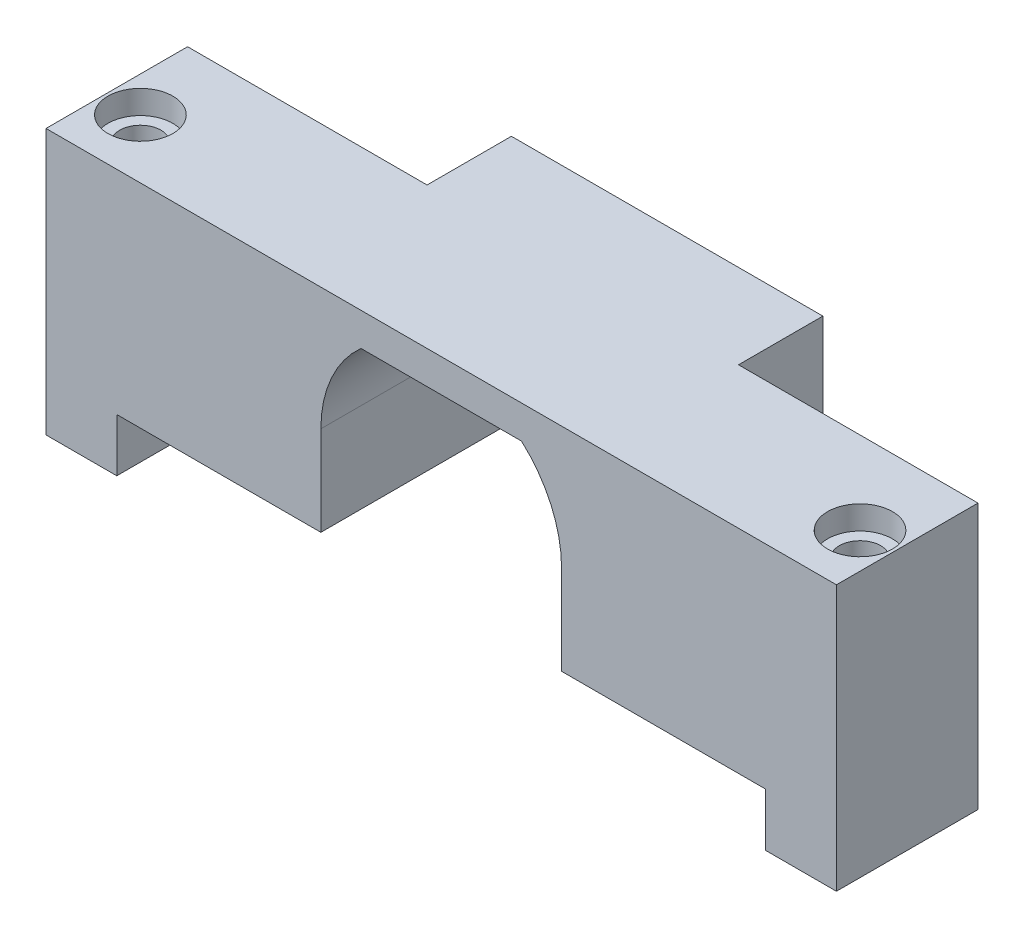
ISO-10303-21;
HEADER;
FILE_DESCRIPTION(('STEP AP214'),'2;1');
FILE_NAME('part.step','',(''),(''),'','','');
FILE_SCHEMA(('AUTOMOTIVE_DESIGN { 1 0 10303 214 1 1 1 1 }'));
ENDSEC;
DATA;
#1=APPLICATION_CONTEXT('core data for automotive mechanical design processes');
#2=APPLICATION_PROTOCOL_DEFINITION('international standard','automotive_design',2000,#1);
#3=PRODUCT_CONTEXT('',#1,'mechanical');
#4=PRODUCT('Part','Part','',(#3));
#5=PRODUCT_RELATED_PRODUCT_CATEGORY('part','',(#4));
#6=PRODUCT_DEFINITION_FORMATION('','',#4);
#7=PRODUCT_DEFINITION_CONTEXT('part definition',#1,'design');
#8=PRODUCT_DEFINITION('design','',#6,#7);
#9=PRODUCT_DEFINITION_SHAPE('','',#8);
#10=(LENGTH_UNIT() NAMED_UNIT(*) SI_UNIT(.MILLI.,.METRE.));
#11=(NAMED_UNIT(*) PLANE_ANGLE_UNIT() SI_UNIT($,.RADIAN.));
#12=(NAMED_UNIT(*) SI_UNIT($,.STERADIAN.) SOLID_ANGLE_UNIT());
#13=UNCERTAINTY_MEASURE_WITH_UNIT(LENGTH_MEASURE(1.E-05),#10,'distance_accuracy_value','');
#14=(GEOMETRIC_REPRESENTATION_CONTEXT(3) GLOBAL_UNCERTAINTY_ASSIGNED_CONTEXT((#13)) GLOBAL_UNIT_ASSIGNED_CONTEXT((#10,
#11,#12)) REPRESENTATION_CONTEXT('',''));
#15=CARTESIAN_POINT('',(0.,0.,0.));
#16=DIRECTION('',(0.,0.,1.));
#17=DIRECTION('',(1.,0.,0.));
#18=AXIS2_PLACEMENT_3D('',#15,#16,#17);
#19=CARTESIAN_POINT('',(58.,-9.44974746830584,6.99999999999999));
#20=DIRECTION('',(0.,1.,0.));
#21=DIRECTION('',(0.,0.,1.));
#22=AXIS2_PLACEMENT_3D('',#19,#20,#21);
#23=CYLINDRICAL_SURFACE('',#22,1.75);
#24=CARTESIAN_POINT('',(58.,-4.5,6.99999999999999));
#25=DIRECTION('',(0.,1.,0.));
#26=DIRECTION('',(0.,0.,1.));
#27=AXIS2_PLACEMENT_3D('',#24,#25,#26);
#28=CIRCLE('',#27,1.75);
#29=CARTESIAN_POINT('',(58.,-4.5,8.75));
#30=VERTEX_POINT('',#29);
#31=EDGE_CURVE('E303',#30,#30,#28,.F.);
#32=ORIENTED_EDGE('',*,*,#31,.T.);
#33=EDGE_LOOP('',(#32));
#34=FACE_BOUND('',#33,.T.);
#35=CARTESIAN_POINT('',(58.,16.,6.99999999999999));
#36=DIRECTION('',(0.,1.,0.));
#37=DIRECTION('',(0.,0.,1.));
#38=AXIS2_PLACEMENT_3D('',#35,#36,#37);
#39=CIRCLE('',#38,1.75);
#40=CARTESIAN_POINT('',(58.,16.,8.75));
#41=VERTEX_POINT('',#40);
#42=EDGE_CURVE('E45',#41,#41,#39,.F.);
#43=ORIENTED_EDGE('',*,*,#42,.F.);
#44=EDGE_LOOP('',(#43));
#45=FACE_BOUND('',#44,.T.);
#46=ADVANCED_FACE('F41',(#34,#45),#23,.F.);
#47=CARTESIAN_POINT('',(-3.,-9.44974746830584,7.));
#48=DIRECTION('',(0.,1.,0.));
#49=DIRECTION('',(0.,0.,1.));
#50=AXIS2_PLACEMENT_3D('',#47,#48,#49);
#51=CYLINDRICAL_SURFACE('',#50,1.75);
#52=CARTESIAN_POINT('',(-3.,-4.5,7.));
#53=DIRECTION('',(0.,1.,0.));
#54=DIRECTION('',(0.,0.,1.));
#55=AXIS2_PLACEMENT_3D('',#52,#53,#54);
#56=CIRCLE('',#55,1.75);
#57=CARTESIAN_POINT('',(-3.,-4.5,8.75));
#58=VERTEX_POINT('',#57);
#59=EDGE_CURVE('E304',#58,#58,#56,.F.);
#60=ORIENTED_EDGE('',*,*,#59,.T.);
#61=EDGE_LOOP('',(#60));
#62=FACE_BOUND('',#61,.T.);
#63=CARTESIAN_POINT('',(-3.,16.,7.));
#64=DIRECTION('',(0.,1.,0.));
#65=DIRECTION('',(0.,0.,1.));
#66=AXIS2_PLACEMENT_3D('',#63,#64,#65);
#67=CIRCLE('',#66,1.75);
#68=CARTESIAN_POINT('',(-3.,16.,8.75));
#69=VERTEX_POINT('',#68);
#70=EDGE_CURVE('E446',#69,#69,#67,.F.);
#71=ORIENTED_EDGE('',*,*,#70,.F.);
#72=EDGE_LOOP('',(#71));
#73=FACE_BOUND('',#72,.T.);
#74=ADVANCED_FACE('F495',(#62,#73),#51,.F.);
#75=CARTESIAN_POINT('',(0.,0.,0.));
#76=DIRECTION('',(0.,0.,1.));
#77=DIRECTION('',(1.,0.,0.));
#78=AXIS2_PLACEMENT_3D('',#75,#76,#77);
#79=PLANE('',#78);
#80=DIRECTION('',(0.,1.,0.));
#81=VECTOR('',#80,1.);
#82=CARTESIAN_POINT('',(14.3,0.,0.));
#83=LINE('',#82,#81);
#84=CARTESIAN_POINT('',(14.3,0.,0.));
#85=VERTEX_POINT('',#84);
#86=CARTESIAN_POINT('',(14.3,18.,0.));
#87=VERTEX_POINT('',#86);
#88=EDGE_CURVE('E237',#85,#87,#83,.T.);
#89=ORIENTED_EDGE('',*,*,#88,.F.);
#90=DIRECTION('',(1.,0.,0.));
#91=VECTOR('',#90,1.);
#92=CARTESIAN_POINT('',(0.,0.,0.));
#93=LINE('',#92,#91);
#94=CARTESIAN_POINT('',(0.,0.,0.));
#95=VERTEX_POINT('',#94);
#96=EDGE_CURVE('E419',#95,#85,#93,.T.);
#97=ORIENTED_EDGE('',*,*,#96,.F.);
#98=DIRECTION('',(0.,-1.,0.));
#99=VECTOR('',#98,1.);
#100=CARTESIAN_POINT('',(0.,18.,0.));
#101=LINE('',#100,#99);
#102=CARTESIAN_POINT('',(0.,-4.5,0.));
#103=VERTEX_POINT('',#102);
#104=EDGE_CURVE('E344',#95,#103,#101,.T.);
#105=ORIENTED_EDGE('',*,*,#104,.T.);
#106=DIRECTION('',(1.,0.,0.));
#107=VECTOR('',#106,1.);
#108=CARTESIAN_POINT('',(-6.,-4.5,0.));
#109=LINE('',#108,#107);
#110=CARTESIAN_POINT('',(-6.,-4.5,0.));
#111=VERTEX_POINT('',#110);
#112=EDGE_CURVE('E373',#111,#103,#109,.T.);
#113=ORIENTED_EDGE('',*,*,#112,.F.);
#114=DIRECTION('',(0.,-1.,0.));
#115=VECTOR('',#114,1.);
#116=CARTESIAN_POINT('',(-6.,18.,0.));
#117=LINE('',#116,#115);
#118=CARTESIAN_POINT('',(-6.,18.,0.));
#119=VERTEX_POINT('',#118);
#120=EDGE_CURVE('E345',#119,#111,#117,.T.);
#121=ORIENTED_EDGE('',*,*,#120,.F.);
#122=DIRECTION('',(1.,0.,0.));
#123=VECTOR('',#122,1.);
#124=CARTESIAN_POINT('',(0.,18.,0.));
#125=LINE('',#124,#123);
#126=EDGE_CURVE('E416',#119,#87,#125,.T.);
#127=ORIENTED_EDGE('',*,*,#126,.T.);
#128=EDGE_LOOP('',(#89,#97,#105,#113,#121,#127));
#129=FACE_BOUND('',#128,.T.);
#130=ADVANCED_FACE('F501',(#129),#79,.F.);
#131=DIRECTION('',(0.,-1.,0.));
#132=VECTOR('',#131,1.);
#133=CARTESIAN_POINT('',(40.7,0.,0.));
#134=LINE('',#133,#132);
#135=CARTESIAN_POINT('',(40.7,18.,0.));
#136=VERTEX_POINT('',#135);
#137=CARTESIAN_POINT('',(40.7,0.,0.));
#138=VERTEX_POINT('',#137);
#139=EDGE_CURVE('E272',#136,#138,#134,.T.);
#140=ORIENTED_EDGE('',*,*,#139,.F.);
#141=CARTESIAN_POINT('',(61.,18.,0.));
#142=VERTEX_POINT('',#141);
#143=EDGE_CURVE('E201',#136,#142,#125,.T.);
#144=ORIENTED_EDGE('',*,*,#143,.T.);
#145=DIRECTION('',(0.,1.,0.));
#146=VECTOR('',#145,1.);
#147=CARTESIAN_POINT('',(61.,18.,0.));
#148=LINE('',#147,#146);
#149=CARTESIAN_POINT('',(61.,-4.5,0.));
#150=VERTEX_POINT('',#149);
#151=EDGE_CURVE('E320',#150,#142,#148,.T.);
#152=ORIENTED_EDGE('',*,*,#151,.F.);
#153=DIRECTION('',(-1.,0.,0.));
#154=VECTOR('',#153,1.);
#155=CARTESIAN_POINT('',(61.,-4.5,0.));
#156=LINE('',#155,#154);
#157=CARTESIAN_POINT('',(55.,-4.5,0.));
#158=VERTEX_POINT('',#157);
#159=EDGE_CURVE('E328',#150,#158,#156,.T.);
#160=ORIENTED_EDGE('',*,*,#159,.T.);
#161=DIRECTION('',(0.,1.,0.));
#162=VECTOR('',#161,1.);
#163=CARTESIAN_POINT('',(55.,18.,0.));
#164=LINE('',#163,#162);
#165=CARTESIAN_POINT('',(55.,0.,0.));
#166=VERTEX_POINT('',#165);
#167=EDGE_CURVE('E317',#158,#166,#164,.T.);
#168=ORIENTED_EDGE('',*,*,#167,.T.);
#169=DIRECTION('',(1.,0.,0.));
#170=VECTOR('',#169,1.);
#171=CARTESIAN_POINT('',(0.,0.,0.));
#172=LINE('',#171,#170);
#173=EDGE_CURVE('E413',#138,#166,#172,.T.);
#174=ORIENTED_EDGE('',*,*,#173,.F.);
#175=EDGE_LOOP('',(#140,#144,#152,#160,#168,#174));
#176=FACE_BOUND('',#175,.T.);
#177=ADVANCED_FACE('F539',(#176),#79,.F.);
#178=CARTESIAN_POINT('',(27.5,7.6,12.));
#179=DIRECTION('',(0.,0.,-1.));
#180=DIRECTION('',(-1.,0.,0.));
#181=AXIS2_PLACEMENT_3D('',#178,#179,#180);
#182=CYLINDRICAL_SURFACE('',#181,10.2);
#183=CARTESIAN_POINT('',(27.5,7.6,0.));
#184=DIRECTION('',(0.,0.,1.));
#185=DIRECTION('',(1.,0.,0.));
#186=AXIS2_PLACEMENT_3D('',#183,#184,#185);
#187=CIRCLE('',#186,10.2);
#188=CARTESIAN_POINT('',(17.4254901960784,9.19507122433081,0.));
#189=VERTEX_POINT('',#188);
#190=CARTESIAN_POINT('',(17.3,7.6,0.));
#191=VERTEX_POINT('',#190);
#192=EDGE_CURVE('E377',#189,#191,#187,.T.);
#193=ORIENTED_EDGE('',*,*,#192,.F.);
#194=DIRECTION('',(0.,0.,1.));
#195=VECTOR('',#194,1.);
#196=CARTESIAN_POINT('',(17.4254901960784,9.19507122433082,-4.65));
#197=LINE('',#196,#195);
#198=CARTESIAN_POINT('',(17.4254901960784,9.19507122433082,-4.65));
#199=VERTEX_POINT('',#198);
#200=EDGE_CURVE('E288',#199,#189,#197,.T.);
#201=ORIENTED_EDGE('',*,*,#200,.F.);
#202=CARTESIAN_POINT('',(27.5,7.6,-4.65));
#203=DIRECTION('',(0.,0.,1.));
#204=DIRECTION('',(1.,0.,0.));
#205=AXIS2_PLACEMENT_3D('',#202,#203,#204);
#206=CIRCLE('',#205,10.2);
#207=CARTESIAN_POINT('',(20.697059459322,15.2,-4.65));
#208=VERTEX_POINT('',#207);
#209=EDGE_CURVE('E256',#208,#199,#206,.T.);
#210=ORIENTED_EDGE('',*,*,#209,.F.);
#211=DIRECTION('',(0.,0.,-1.));
#212=VECTOR('',#211,1.);
#213=CARTESIAN_POINT('',(20.697059459322,15.2,12.));
#214=LINE('',#213,#212);
#215=CARTESIAN_POINT('',(20.697059459322,15.2,12.));
#216=VERTEX_POINT('',#215);
#217=EDGE_CURVE('E11',#216,#208,#214,.T.);
#218=ORIENTED_EDGE('',*,*,#217,.F.);
#219=CARTESIAN_POINT('',(27.5,7.6,12.));
#220=DIRECTION('',(0.,0.,1.));
#221=DIRECTION('',(1.,0.,0.));
#222=AXIS2_PLACEMENT_3D('',#219,#220,#221);
#223=CIRCLE('',#222,10.2);
#224=CARTESIAN_POINT('',(17.3,7.6,12.));
#225=VERTEX_POINT('',#224);
#226=EDGE_CURVE('E378',#216,#225,#223,.T.);
#227=ORIENTED_EDGE('',*,*,#226,.T.);
#228=DIRECTION('',(0.,0.,-1.));
#229=VECTOR('',#228,1.);
#230=CARTESIAN_POINT('',(17.3,7.6,12.));
#231=LINE('',#230,#229);
#232=EDGE_CURVE('E405',#225,#191,#231,.T.);
#233=ORIENTED_EDGE('',*,*,#232,.T.);
#234=EDGE_LOOP('',(#193,#201,#210,#218,#227,#233));
#235=FACE_BOUND('',#234,.T.);
#236=ADVANCED_FACE('F43',(#235),#182,.F.);
#237=CARTESIAN_POINT('',(0.,15.2,12.));
#238=DIRECTION('',(0.,1.,0.));
#239=DIRECTION('',(0.,0.,1.));
#240=AXIS2_PLACEMENT_3D('',#237,#238,#239);
#241=PLANE('',#240);
#242=ORIENTED_EDGE('',*,*,#217,.T.);
#243=DIRECTION('',(-1.,0.,0.));
#244=VECTOR('',#243,1.);
#245=CARTESIAN_POINT('',(20.697059459322,15.2,-4.65));
#246=LINE('',#245,#244);
#247=CARTESIAN_POINT('',(34.302940540678,15.2,-4.65));
#248=VERTEX_POINT('',#247);
#249=EDGE_CURVE('E252',#248,#208,#246,.T.);
#250=ORIENTED_EDGE('',*,*,#249,.F.);
#251=DIRECTION('',(0.,0.,-1.));
#252=VECTOR('',#251,1.);
#253=CARTESIAN_POINT('',(34.302940540678,15.2,12.));
#254=LINE('',#253,#252);
#255=CARTESIAN_POINT('',(34.302940540678,15.2,12.));
#256=VERTEX_POINT('',#255);
#257=EDGE_CURVE('E51',#256,#248,#254,.T.);
#258=ORIENTED_EDGE('',*,*,#257,.F.);
#259=DIRECTION('',(1.,0.,0.));
#260=VECTOR('',#259,1.);
#261=CARTESIAN_POINT('',(0.,15.2,12.));
#262=LINE('',#261,#260);
#263=EDGE_CURVE('E382',#216,#256,#262,.T.);
#264=ORIENTED_EDGE('',*,*,#263,.F.);
#265=EDGE_LOOP('',(#242,#250,#258,#264));
#266=FACE_BOUND('',#265,.T.);
#267=ADVANCED_FACE('F556',(#266),#241,.F.);
#268=CARTESIAN_POINT('',(27.5,7.6,12.));
#269=DIRECTION('',(0.,0.,-1.));
#270=DIRECTION('',(-1.,0.,0.));
#271=AXIS2_PLACEMENT_3D('',#268,#269,#270);
#272=CYLINDRICAL_SURFACE('',#271,10.2);
#273=CARTESIAN_POINT('',(27.5,7.6,0.));
#274=DIRECTION('',(0.,0.,1.));
#275=DIRECTION('',(1.,0.,0.));
#276=AXIS2_PLACEMENT_3D('',#273,#274,#275);
#277=CIRCLE('',#276,10.2);
#278=CARTESIAN_POINT('',(37.7,7.6,0.));
#279=VERTEX_POINT('',#278);
#280=CARTESIAN_POINT('',(37.5745098039216,9.19507122433082,0.));
#281=VERTEX_POINT('',#280);
#282=EDGE_CURVE('E59',#279,#281,#277,.T.);
#283=ORIENTED_EDGE('',*,*,#282,.F.);
#284=DIRECTION('',(0.,0.,-1.));
#285=VECTOR('',#284,1.);
#286=CARTESIAN_POINT('',(37.7,7.6,12.));
#287=LINE('',#286,#285);
#288=CARTESIAN_POINT('',(37.7,7.6,12.));
#289=VERTEX_POINT('',#288);
#290=EDGE_CURVE('E442',#289,#279,#287,.T.);
#291=ORIENTED_EDGE('',*,*,#290,.F.);
#292=CARTESIAN_POINT('',(27.5,7.6,12.));
#293=DIRECTION('',(0.,0.,1.));
#294=DIRECTION('',(1.,0.,0.));
#295=AXIS2_PLACEMENT_3D('',#292,#293,#294);
#296=CIRCLE('',#295,10.2);
#297=EDGE_CURVE('E386',#289,#256,#296,.T.);
#298=ORIENTED_EDGE('',*,*,#297,.T.);
#299=ORIENTED_EDGE('',*,*,#257,.T.);
#300=CARTESIAN_POINT('',(27.5,7.6,-4.65));
#301=DIRECTION('',(0.,0.,1.));
#302=DIRECTION('',(-1.,0.,0.));
#303=AXIS2_PLACEMENT_3D('',#300,#301,#302);
#304=CIRCLE('',#303,10.2);
#305=CARTESIAN_POINT('',(37.5745098039216,9.19507122433081,-4.65));
#306=VERTEX_POINT('',#305);
#307=EDGE_CURVE('E248',#306,#248,#304,.T.);
#308=ORIENTED_EDGE('',*,*,#307,.F.);
#309=DIRECTION('',(0.,0.,1.));
#310=VECTOR('',#309,1.);
#311=CARTESIAN_POINT('',(37.5745098039216,9.19507122433081,-4.65));
#312=LINE('',#311,#310);
#313=EDGE_CURVE('E292',#306,#281,#312,.T.);
#314=ORIENTED_EDGE('',*,*,#313,.T.);
#315=EDGE_LOOP('',(#283,#291,#298,#299,#308,#314));
#316=FACE_BOUND('',#315,.T.);
#317=ADVANCED_FACE('F554',(#316),#272,.F.);
#318=CARTESIAN_POINT('',(37.7,0.,12.));
#319=DIRECTION('',(1.,0.,0.));
#320=DIRECTION('',(0.,0.,-1.));
#321=AXIS2_PLACEMENT_3D('',#318,#319,#320);
#322=PLANE('',#321);
#323=DIRECTION('',(0.,-1.,0.));
#324=VECTOR('',#323,1.);
#325=CARTESIAN_POINT('',(37.7,0.,0.));
#326=LINE('',#325,#324);
#327=CARTESIAN_POINT('',(37.7,6.,0.));
#328=VERTEX_POINT('',#327);
#329=EDGE_CURVE('E66',#279,#328,#326,.T.);
#330=ORIENTED_EDGE('',*,*,#329,.T.);
#331=DIRECTION('',(0.,0.,1.));
#332=VECTOR('',#331,1.);
#333=CARTESIAN_POINT('',(37.7,6.,-4.65));
#334=LINE('',#333,#332);
#335=CARTESIAN_POINT('',(37.7,6.,-4.65));
#336=VERTEX_POINT('',#335);
#337=EDGE_CURVE('E296',#336,#328,#334,.T.);
#338=ORIENTED_EDGE('',*,*,#337,.F.);
#339=DIRECTION('',(0.,1.,0.));
#340=VECTOR('',#339,1.);
#341=CARTESIAN_POINT('',(37.7,6.,-4.65));
#342=LINE('',#341,#340);
#343=CARTESIAN_POINT('',(37.7,0.,-4.65));
#344=VERTEX_POINT('',#343);
#345=EDGE_CURVE('E239',#344,#336,#342,.T.);
#346=ORIENTED_EDGE('',*,*,#345,.F.);
#347=DIRECTION('',(0.,0.,-1.));
#348=VECTOR('',#347,1.);
#349=CARTESIAN_POINT('',(37.7,0.,12.));
#350=LINE('',#349,#348);
#351=CARTESIAN_POINT('',(37.7,0.,12.));
#352=VERTEX_POINT('',#351);
#353=EDGE_CURVE('E439',#352,#344,#350,.T.);
#354=ORIENTED_EDGE('',*,*,#353,.F.);
#355=DIRECTION('',(0.,-1.,0.));
#356=VECTOR('',#355,1.);
#357=CARTESIAN_POINT('',(37.7,0.,12.));
#358=LINE('',#357,#356);
#359=EDGE_CURVE('E390',#289,#352,#358,.T.);
#360=ORIENTED_EDGE('',*,*,#359,.F.);
#361=ORIENTED_EDGE('',*,*,#290,.T.);
#362=EDGE_LOOP('',(#330,#338,#346,#354,#360,#361));
#363=FACE_BOUND('',#362,.T.);
#364=ADVANCED_FACE('F550',(#363),#322,.F.);
#365=CARTESIAN_POINT('',(0.,18.,12.));
#366=DIRECTION('',(0.,1.,0.));
#367=DIRECTION('',(0.,0.,1.));
#368=AXIS2_PLACEMENT_3D('',#365,#366,#367);
#369=PLANE('',#368);
#370=CARTESIAN_POINT('',(-3.,18.,7.));
#371=DIRECTION('',(0.,1.,0.));
#372=DIRECTION('',(0.,0.,1.));
#373=AXIS2_PLACEMENT_3D('',#370,#371,#372);
#374=CIRCLE('',#373,2.75);
#375=CARTESIAN_POINT('',(-3.,18.,9.75));
#376=VERTEX_POINT('',#375);
#377=EDGE_CURVE('E456',#376,#376,#374,.T.);
#378=ORIENTED_EDGE('',*,*,#377,.F.);
#379=EDGE_LOOP('',(#378));
#380=FACE_BOUND('',#379,.T.);
#381=CARTESIAN_POINT('',(58.,18.,6.99999999999999));
#382=DIRECTION('',(0.,1.,0.));
#383=DIRECTION('',(0.,0.,1.));
#384=AXIS2_PLACEMENT_3D('',#381,#382,#383);
#385=CIRCLE('',#384,2.75);
#386=CARTESIAN_POINT('',(58.,18.,9.74999999999999));
#387=VERTEX_POINT('',#386);
#388=EDGE_CURVE('E468',#387,#387,#385,.T.);
#389=ORIENTED_EDGE('',*,*,#388,.F.);
#390=EDGE_LOOP('',(#389));
#391=FACE_BOUND('',#390,.T.);
#392=ORIENTED_EDGE('',*,*,#126,.F.);
#393=DIRECTION('',(0.,0.,-1.));
#394=VECTOR('',#393,1.);
#395=CARTESIAN_POINT('',(-6.,18.,0.));
#396=LINE('',#395,#394);
#397=CARTESIAN_POINT('',(-6.,18.,12.));
#398=VERTEX_POINT('',#397);
#399=EDGE_CURVE('E357',#398,#119,#396,.T.);
#400=ORIENTED_EDGE('',*,*,#399,.F.);
#401=DIRECTION('',(1.,0.,0.));
#402=VECTOR('',#401,1.);
#403=CARTESIAN_POINT('',(0.,18.,12.));
#404=LINE('',#403,#402);
#405=CARTESIAN_POINT('',(61.,18.,12.));
#406=VERTEX_POINT('',#405);
#407=EDGE_CURVE('E396',#398,#406,#404,.T.);
#408=ORIENTED_EDGE('',*,*,#407,.T.);
#409=DIRECTION('',(0.,0.,1.));
#410=VECTOR('',#409,1.);
#411=CARTESIAN_POINT('',(61.,18.,12.));
#412=LINE('',#411,#410);
#413=EDGE_CURVE('E324',#142,#406,#412,.T.);
#414=ORIENTED_EDGE('',*,*,#413,.F.);
#415=ORIENTED_EDGE('',*,*,#143,.F.);
#416=DIRECTION('',(0.,0.,1.));
#417=VECTOR('',#416,1.);
#418=CARTESIAN_POINT('',(40.7,18.,-4.65));
#419=LINE('',#418,#417);
#420=CARTESIAN_POINT('',(40.7,18.,-7.15));
#421=VERTEX_POINT('',#420);
#422=EDGE_CURVE('E194',#421,#136,#419,.T.);
#423=ORIENTED_EDGE('',*,*,#422,.F.);
#424=DIRECTION('',(1.,0.,0.));
#425=VECTOR('',#424,1.);
#426=CARTESIAN_POINT('',(14.3,18.,-7.15));
#427=LINE('',#426,#425);
#428=CARTESIAN_POINT('',(14.3,18.,-7.15));
#429=VERTEX_POINT('',#428);
#430=EDGE_CURVE('E199',#429,#421,#427,.T.);
#431=ORIENTED_EDGE('',*,*,#430,.F.);
#432=DIRECTION('',(0.,0.,1.));
#433=VECTOR('',#432,1.);
#434=CARTESIAN_POINT('',(14.3,18.,-4.65));
#435=LINE('',#434,#433);
#436=EDGE_CURVE('E205',#429,#87,#435,.T.);
#437=ORIENTED_EDGE('',*,*,#436,.T.);
#438=EDGE_LOOP('',(#392,#400,#408,#414,#415,#423,#431,#437));
#439=FACE_BOUND('',#438,.T.);
#440=ADVANCED_FACE('F196',(#380,#391,#439),#369,.T.);
#441=CARTESIAN_POINT('',(0.,0.,12.));
#442=DIRECTION('',(0.,1.,0.));
#443=DIRECTION('',(0.,0.,1.));
#444=AXIS2_PLACEMENT_3D('',#441,#442,#443);
#445=PLANE('',#444);
#446=ORIENTED_EDGE('',*,*,#96,.T.);
#447=DIRECTION('',(0.,0.,1.));
#448=VECTOR('',#447,1.);
#449=CARTESIAN_POINT('',(14.3,0.,-4.65));
#450=LINE('',#449,#448);
#451=CARTESIAN_POINT('',(14.3,0.,-7.15));
#452=VERTEX_POINT('',#451);
#453=EDGE_CURVE('E268',#452,#85,#450,.T.);
#454=ORIENTED_EDGE('',*,*,#453,.F.);
#455=DIRECTION('',(-1.,0.,0.));
#456=VECTOR('',#455,1.);
#457=CARTESIAN_POINT('',(40.7,0.,-7.15));
#458=LINE('',#457,#456);
#459=CARTESIAN_POINT('',(40.7,0.,-7.15));
#460=VERTEX_POINT('',#459);
#461=EDGE_CURVE('E216',#460,#452,#458,.T.);
#462=ORIENTED_EDGE('',*,*,#461,.F.);
#463=DIRECTION('',(0.,0.,1.));
#464=VECTOR('',#463,1.);
#465=CARTESIAN_POINT('',(40.7,0.,-4.65));
#466=LINE('',#465,#464);
#467=EDGE_CURVE('E206',#460,#138,#466,.T.);
#468=ORIENTED_EDGE('',*,*,#467,.T.);
#469=ORIENTED_EDGE('',*,*,#173,.T.);
#470=DIRECTION('',(0.,0.,-1.));
#471=VECTOR('',#470,1.);
#472=CARTESIAN_POINT('',(55.,0.,12.));
#473=LINE('',#472,#471);
#474=CARTESIAN_POINT('',(55.,0.,12.));
#475=VERTEX_POINT('',#474);
#476=EDGE_CURVE('E435',#475,#166,#473,.T.);
#477=ORIENTED_EDGE('',*,*,#476,.F.);
#478=DIRECTION('',(1.,0.,0.));
#479=VECTOR('',#478,1.);
#480=CARTESIAN_POINT('',(0.,0.,12.));
#481=LINE('',#480,#479);
#482=EDGE_CURVE('E393',#352,#475,#481,.T.);
#483=ORIENTED_EDGE('',*,*,#482,.F.);
#484=ORIENTED_EDGE('',*,*,#353,.T.);
#485=DIRECTION('',(-1.,0.,0.));
#486=VECTOR('',#485,1.);
#487=CARTESIAN_POINT('',(40.7,0.,-4.65));
#488=LINE('',#487,#486);
#489=CARTESIAN_POINT('',(17.3,0.,-4.65));
#490=VERTEX_POINT('',#489);
#491=EDGE_CURVE('E224',#344,#490,#488,.T.);
#492=ORIENTED_EDGE('',*,*,#491,.T.);
#493=DIRECTION('',(0.,0.,-1.));
#494=VECTOR('',#493,1.);
#495=CARTESIAN_POINT('',(17.3,0.,12.));
#496=LINE('',#495,#494);
#497=CARTESIAN_POINT('',(17.3,0.,12.));
#498=VERTEX_POINT('',#497);
#499=EDGE_CURVE('E428',#498,#490,#496,.T.);
#500=ORIENTED_EDGE('',*,*,#499,.F.);
#501=DIRECTION('',(1.,0.,0.));
#502=VECTOR('',#501,1.);
#503=CARTESIAN_POINT('',(0.,0.,12.));
#504=LINE('',#503,#502);
#505=CARTESIAN_POINT('',(0.,0.,12.));
#506=VERTEX_POINT('',#505);
#507=EDGE_CURVE('E399',#506,#498,#504,.T.);
#508=ORIENTED_EDGE('',*,*,#507,.F.);
#509=DIRECTION('',(0.,0.,-1.));
#510=VECTOR('',#509,1.);
#511=CARTESIAN_POINT('',(0.,0.,12.));
#512=LINE('',#511,#510);
#513=EDGE_CURVE('E431',#506,#95,#512,.T.);
#514=ORIENTED_EDGE('',*,*,#513,.T.);
#515=EDGE_LOOP('',(#446,#454,#462,#468,#469,#477,#483,#484,#492,#500,#508,#514));
#516=FACE_BOUND('',#515,.T.);
#517=ADVANCED_FACE('F543',(#516),#445,.F.);
#518=CARTESIAN_POINT('',(17.3,0.,12.));
#519=DIRECTION('',(-1.,0.,0.));
#520=DIRECTION('',(0.,-1.,0.));
#521=AXIS2_PLACEMENT_3D('',#518,#519,#520);
#522=PLANE('',#521);
#523=ORIENTED_EDGE('',*,*,#499,.T.);
#524=DIRECTION('',(0.,-1.,0.));
#525=VECTOR('',#524,1.);
#526=CARTESIAN_POINT('',(17.3,6.,-4.65));
#527=LINE('',#526,#525);
#528=CARTESIAN_POINT('',(17.3,6.,-4.65));
#529=VERTEX_POINT('',#528);
#530=EDGE_CURVE('E264',#529,#490,#527,.T.);
#531=ORIENTED_EDGE('',*,*,#530,.F.);
#532=DIRECTION('',(0.,0.,1.));
#533=VECTOR('',#532,1.);
#534=CARTESIAN_POINT('',(17.3,6.,-4.65));
#535=LINE('',#534,#533);
#536=CARTESIAN_POINT('',(17.3,6.,0.));
#537=VERTEX_POINT('',#536);
#538=EDGE_CURVE('E284',#529,#537,#535,.T.);
#539=ORIENTED_EDGE('',*,*,#538,.T.);
#540=DIRECTION('',(0.,1.,0.));
#541=VECTOR('',#540,1.);
#542=CARTESIAN_POINT('',(17.3,0.,0.));
#543=LINE('',#542,#541);
#544=EDGE_CURVE('E383',#537,#191,#543,.T.);
#545=ORIENTED_EDGE('',*,*,#544,.T.);
#546=ORIENTED_EDGE('',*,*,#232,.F.);
#547=DIRECTION('',(0.,1.,0.));
#548=VECTOR('',#547,1.);
#549=CARTESIAN_POINT('',(17.3,0.,12.));
#550=LINE('',#549,#548);
#551=EDGE_CURVE('E402',#498,#225,#550,.T.);
#552=ORIENTED_EDGE('',*,*,#551,.F.);
#553=EDGE_LOOP('',(#523,#531,#539,#545,#546,#552));
#554=FACE_BOUND('',#553,.T.);
#555=ADVANCED_FACE('F535',(#554),#522,.F.);
#556=CARTESIAN_POINT('',(0.,0.,12.));
#557=DIRECTION('',(0.,0.,1.));
#558=DIRECTION('',(1.,0.,0.));
#559=AXIS2_PLACEMENT_3D('',#556,#557,#558);
#560=PLANE('',#559);
#561=ORIENTED_EDGE('',*,*,#226,.F.);
#562=ORIENTED_EDGE('',*,*,#263,.T.);
#563=ORIENTED_EDGE('',*,*,#297,.F.);
#564=ORIENTED_EDGE('',*,*,#359,.T.);
#565=ORIENTED_EDGE('',*,*,#482,.T.);
#566=DIRECTION('',(0.,-1.,0.));
#567=VECTOR('',#566,1.);
#568=CARTESIAN_POINT('',(55.,18.,12.));
#569=LINE('',#568,#567);
#570=CARTESIAN_POINT('',(55.,-4.5,12.));
#571=VERTEX_POINT('',#570);
#572=EDGE_CURVE('E308',#475,#571,#569,.T.);
#573=ORIENTED_EDGE('',*,*,#572,.T.);
#574=DIRECTION('',(-1.,0.,0.));
#575=VECTOR('',#574,1.);
#576=CARTESIAN_POINT('',(61.,-4.5,12.));
#577=LINE('',#576,#575);
#578=CARTESIAN_POINT('',(61.,-4.5,12.));
#579=VERTEX_POINT('',#578);
#580=EDGE_CURVE('E340',#579,#571,#577,.T.);
#581=ORIENTED_EDGE('',*,*,#580,.F.);
#582=DIRECTION('',(0.,-1.,0.));
#583=VECTOR('',#582,1.);
#584=CARTESIAN_POINT('',(61.,18.,12.));
#585=LINE('',#584,#583);
#586=EDGE_CURVE('E312',#406,#579,#585,.T.);
#587=ORIENTED_EDGE('',*,*,#586,.F.);
#588=ORIENTED_EDGE('',*,*,#407,.F.);
#589=DIRECTION('',(0.,1.,0.));
#590=VECTOR('',#589,1.);
#591=CARTESIAN_POINT('',(-6.,18.,12.));
#592=LINE('',#591,#590);
#593=CARTESIAN_POINT('',(-6.,-4.5,12.));
#594=VERTEX_POINT('',#593);
#595=EDGE_CURVE('E353',#594,#398,#592,.T.);
#596=ORIENTED_EDGE('',*,*,#595,.F.);
#597=DIRECTION('',(1.,0.,0.));
#598=VECTOR('',#597,1.);
#599=CARTESIAN_POINT('',(-6.,-4.5,12.));
#600=LINE('',#599,#598);
#601=CARTESIAN_POINT('',(0.,-4.5,12.));
#602=VERTEX_POINT('',#601);
#603=EDGE_CURVE('E361',#594,#602,#600,.T.);
#604=ORIENTED_EDGE('',*,*,#603,.T.);
#605=DIRECTION('',(0.,1.,0.));
#606=VECTOR('',#605,1.);
#607=CARTESIAN_POINT('',(0.,18.,12.));
#608=LINE('',#607,#606);
#609=EDGE_CURVE('E350',#602,#506,#608,.T.);
#610=ORIENTED_EDGE('',*,*,#609,.T.);
#611=ORIENTED_EDGE('',*,*,#507,.T.);
#612=ORIENTED_EDGE('',*,*,#551,.T.);
#613=EDGE_LOOP('',(#561,#562,#563,#564,#565,#573,#581,#587,#588,#596,#604,#610,#611,#612));
#614=FACE_BOUND('',#613,.T.);
#615=ADVANCED_FACE('F531',(#614),#560,.T.);
#616=CARTESIAN_POINT('',(-6.,-4.5,0.));
#617=DIRECTION('',(0.,1.,0.));
#618=DIRECTION('',(0.,0.,1.));
#619=AXIS2_PLACEMENT_3D('',#616,#617,#618);
#620=PLANE('',#619);
#621=ORIENTED_EDGE('',*,*,#59,.F.);
#622=EDGE_LOOP('',(#621));
#623=FACE_BOUND('',#622,.T.);
#624=DIRECTION('',(0.,0.,1.));
#625=VECTOR('',#624,1.);
#626=CARTESIAN_POINT('',(0.,-4.5,0.));
#627=LINE('',#626,#625);
#628=EDGE_CURVE('E364',#103,#602,#627,.T.);
#629=ORIENTED_EDGE('',*,*,#628,.T.);
#630=ORIENTED_EDGE('',*,*,#603,.F.);
#631=DIRECTION('',(0.,0.,1.));
#632=VECTOR('',#631,1.);
#633=CARTESIAN_POINT('',(-6.,-4.5,0.));
#634=LINE('',#633,#632);
#635=EDGE_CURVE('E349',#111,#594,#634,.T.);
#636=ORIENTED_EDGE('',*,*,#635,.F.);
#637=ORIENTED_EDGE('',*,*,#112,.T.);
#638=EDGE_LOOP('',(#629,#630,#636,#637));
#639=FACE_BOUND('',#638,.T.);
#640=ADVANCED_FACE('F524',(#623,#639),#620,.F.);
#641=CARTESIAN_POINT('',(-6.,0.,0.));
#642=DIRECTION('',(-1.,0.,0.));
#643=DIRECTION('',(0.,0.,1.));
#644=AXIS2_PLACEMENT_3D('',#641,#642,#643);
#645=PLANE('',#644);
#646=ORIENTED_EDGE('',*,*,#120,.T.);
#647=ORIENTED_EDGE('',*,*,#635,.T.);
#648=ORIENTED_EDGE('',*,*,#595,.T.);
#649=ORIENTED_EDGE('',*,*,#399,.T.);
#650=EDGE_LOOP('',(#646,#647,#648,#649));
#651=FACE_BOUND('',#650,.T.);
#652=ADVANCED_FACE('F521',(#651),#645,.T.);
#653=CARTESIAN_POINT('',(0.,0.,0.));
#654=DIRECTION('',(-1.,0.,0.));
#655=DIRECTION('',(0.,0.,1.));
#656=AXIS2_PLACEMENT_3D('',#653,#654,#655);
#657=PLANE('',#656);
#658=ORIENTED_EDGE('',*,*,#513,.F.);
#659=ORIENTED_EDGE('',*,*,#609,.F.);
#660=ORIENTED_EDGE('',*,*,#628,.F.);
#661=ORIENTED_EDGE('',*,*,#104,.F.);
#662=EDGE_LOOP('',(#658,#659,#660,#661));
#663=FACE_BOUND('',#662,.T.);
#664=ADVANCED_FACE('F516',(#663),#657,.F.);
#665=CARTESIAN_POINT('',(55.,0.,0.));
#666=DIRECTION('',(1.,0.,0.));
#667=DIRECTION('',(0.,0.,-1.));
#668=AXIS2_PLACEMENT_3D('',#665,#666,#667);
#669=PLANE('',#668);
#670=ORIENTED_EDGE('',*,*,#572,.F.);
#671=ORIENTED_EDGE('',*,*,#476,.T.);
#672=ORIENTED_EDGE('',*,*,#167,.F.);
#673=DIRECTION('',(0.,0.,-1.));
#674=VECTOR('',#673,1.);
#675=CARTESIAN_POINT('',(55.,-4.5,12.));
#676=LINE('',#675,#674);
#677=EDGE_CURVE('E331',#571,#158,#676,.T.);
#678=ORIENTED_EDGE('',*,*,#677,.F.);
#679=EDGE_LOOP('',(#670,#671,#672,#678));
#680=FACE_BOUND('',#679,.T.);
#681=ADVANCED_FACE('F513',(#680),#669,.F.);
#682=CARTESIAN_POINT('',(61.,-4.5,12.));
#683=DIRECTION('',(0.,1.,0.));
#684=DIRECTION('',(0.,0.,1.));
#685=AXIS2_PLACEMENT_3D('',#682,#683,#684);
#686=PLANE('',#685);
#687=ORIENTED_EDGE('',*,*,#31,.F.);
#688=EDGE_LOOP('',(#687));
#689=FACE_BOUND('',#688,.T.);
#690=ORIENTED_EDGE('',*,*,#677,.T.);
#691=ORIENTED_EDGE('',*,*,#159,.F.);
#692=DIRECTION('',(0.,0.,-1.));
#693=VECTOR('',#692,1.);
#694=CARTESIAN_POINT('',(61.,-4.5,12.));
#695=LINE('',#694,#693);
#696=EDGE_CURVE('E316',#579,#150,#695,.T.);
#697=ORIENTED_EDGE('',*,*,#696,.F.);
#698=ORIENTED_EDGE('',*,*,#580,.T.);
#699=EDGE_LOOP('',(#690,#691,#697,#698));
#700=FACE_BOUND('',#699,.T.);
#701=ADVANCED_FACE('F511',(#689,#700),#686,.F.);
#702=CARTESIAN_POINT('',(61.,0.,0.));
#703=DIRECTION('',(1.,0.,0.));
#704=DIRECTION('',(0.,0.,-1.));
#705=AXIS2_PLACEMENT_3D('',#702,#703,#704);
#706=PLANE('',#705);
#707=ORIENTED_EDGE('',*,*,#586,.T.);
#708=ORIENTED_EDGE('',*,*,#696,.T.);
#709=ORIENTED_EDGE('',*,*,#151,.T.);
#710=ORIENTED_EDGE('',*,*,#413,.T.);
#711=EDGE_LOOP('',(#707,#708,#709,#710));
#712=FACE_BOUND('',#711,.T.);
#713=ADVANCED_FACE('F507',(#712),#706,.T.);
#714=CARTESIAN_POINT('',(37.7,7.6,0.));
#715=DIRECTION('',(0.,0.,-1.));
#716=DIRECTION('',(-1.,0.,0.));
#717=AXIS2_PLACEMENT_3D('',#714,#715,#716);
#718=PLANE('',#717);
#719=CARTESIAN_POINT('',(17.3,7.6,0.));
#720=DIRECTION('',(0.,0.,-1.));
#721=DIRECTION('',(1.,0.,0.));
#722=AXIS2_PLACEMENT_3D('',#719,#720,#721);
#723=CIRCLE('',#722,1.6);
#724=EDGE_CURVE('E244',#189,#537,#723,.T.);
#725=ORIENTED_EDGE('',*,*,#724,.F.);
#726=ORIENTED_EDGE('',*,*,#192,.T.);
#727=ORIENTED_EDGE('',*,*,#544,.F.);
#728=EDGE_LOOP('',(#725,#726,#727));
#729=FACE_BOUND('',#728,.T.);
#730=ADVANCED_FACE('F510',(#729),#718,.F.);
#731=CARTESIAN_POINT('',(14.3,0.,-4.65));
#732=DIRECTION('',(1.,0.,0.));
#733=DIRECTION('',(0.,0.,-1.));
#734=AXIS2_PLACEMENT_3D('',#731,#732,#733);
#735=PLANE('',#734);
#736=ORIENTED_EDGE('',*,*,#88,.T.);
#737=ORIENTED_EDGE('',*,*,#436,.F.);
#738=DIRECTION('',(0.,1.,0.));
#739=VECTOR('',#738,1.);
#740=CARTESIAN_POINT('',(14.3,0.,-7.15));
#741=LINE('',#740,#739);
#742=EDGE_CURVE('E222',#452,#429,#741,.T.);
#743=ORIENTED_EDGE('',*,*,#742,.F.);
#744=ORIENTED_EDGE('',*,*,#453,.T.);
#745=EDGE_LOOP('',(#736,#737,#743,#744));
#746=FACE_BOUND('',#745,.T.);
#747=ADVANCED_FACE('F600',(#746),#735,.F.);
#748=CARTESIAN_POINT('',(40.7,0.,-4.65));
#749=DIRECTION('',(-1.,0.,0.));
#750=DIRECTION('',(0.,0.,1.));
#751=AXIS2_PLACEMENT_3D('',#748,#749,#750);
#752=PLANE('',#751);
#753=ORIENTED_EDGE('',*,*,#139,.T.);
#754=ORIENTED_EDGE('',*,*,#467,.F.);
#755=DIRECTION('',(0.,-1.,0.));
#756=VECTOR('',#755,1.);
#757=CARTESIAN_POINT('',(40.7,18.,-7.15));
#758=LINE('',#757,#756);
#759=EDGE_CURVE('E209',#421,#460,#758,.T.);
#760=ORIENTED_EDGE('',*,*,#759,.F.);
#761=ORIENTED_EDGE('',*,*,#422,.T.);
#762=EDGE_LOOP('',(#753,#754,#760,#761));
#763=FACE_BOUND('',#762,.T.);
#764=ADVANCED_FACE('F210',(#763),#752,.F.);
#765=CARTESIAN_POINT('',(37.7,7.6,-4.65));
#766=DIRECTION('',(0.,0.,1.));
#767=DIRECTION('',(1.,0.,0.));
#768=AXIS2_PLACEMENT_3D('',#765,#766,#767);
#769=CYLINDRICAL_SURFACE('',#768,1.6);
#770=CARTESIAN_POINT('',(37.7,7.6,0.));
#771=DIRECTION('',(0.,0.,-1.));
#772=DIRECTION('',(-1.,0.,0.));
#773=AXIS2_PLACEMENT_3D('',#770,#771,#772);
#774=CIRCLE('',#773,1.6);
#775=EDGE_CURVE('E275',#328,#281,#774,.T.);
#776=ORIENTED_EDGE('',*,*,#775,.T.);
#777=ORIENTED_EDGE('',*,*,#313,.F.);
#778=CARTESIAN_POINT('',(37.7,7.6,-4.65));
#779=DIRECTION('',(0.,0.,-1.));
#780=DIRECTION('',(-1.,0.,0.));
#781=AXIS2_PLACEMENT_3D('',#778,#779,#780);
#782=CIRCLE('',#781,1.6);
#783=EDGE_CURVE('E243',#336,#306,#782,.T.);
#784=ORIENTED_EDGE('',*,*,#783,.F.);
#785=ORIENTED_EDGE('',*,*,#337,.T.);
#786=EDGE_LOOP('',(#776,#777,#784,#785));
#787=FACE_BOUND('',#786,.T.);
#788=ADVANCED_FACE('F589',(#787),#769,.T.);
#789=CARTESIAN_POINT('',(17.3,7.6,-4.65));
#790=DIRECTION('',(0.,0.,1.));
#791=DIRECTION('',(1.,0.,0.));
#792=AXIS2_PLACEMENT_3D('',#789,#790,#791);
#793=CYLINDRICAL_SURFACE('',#792,1.6);
#794=ORIENTED_EDGE('',*,*,#724,.T.);
#795=ORIENTED_EDGE('',*,*,#538,.F.);
#796=CARTESIAN_POINT('',(17.3,7.6,-4.65));
#797=DIRECTION('',(0.,0.,-1.));
#798=DIRECTION('',(1.,0.,0.));
#799=AXIS2_PLACEMENT_3D('',#796,#797,#798);
#800=CIRCLE('',#799,1.6);
#801=EDGE_CURVE('E260',#199,#529,#800,.T.);
#802=ORIENTED_EDGE('',*,*,#801,.F.);
#803=ORIENTED_EDGE('',*,*,#200,.T.);
#804=EDGE_LOOP('',(#794,#795,#802,#803));
#805=FACE_BOUND('',#804,.T.);
#806=ADVANCED_FACE('F581',(#805),#793,.T.);
#807=ORIENTED_EDGE('',*,*,#329,.F.);
#808=ORIENTED_EDGE('',*,*,#282,.T.);
#809=ORIENTED_EDGE('',*,*,#775,.F.);
#810=EDGE_LOOP('',(#807,#808,#809));
#811=FACE_BOUND('',#810,.T.);
#812=ADVANCED_FACE('F590',(#811),#718,.F.);
#813=CARTESIAN_POINT('',(0.,0.,-4.65));
#814=DIRECTION('',(0.,0.,-1.));
#815=DIRECTION('',(-1.,0.,0.));
#816=AXIS2_PLACEMENT_3D('',#813,#814,#815);
#817=PLANE('',#816);
#818=CARTESIAN_POINT('',(27.5,7.53720652473903,-4.65));
#819=DIRECTION('',(0.,0.,-1.));
#820=DIRECTION('',(-1.,0.,0.));
#821=AXIS2_PLACEMENT_3D('',#818,#819,#820);
#822=CIRCLE('',#821,4.925);
#823=CARTESIAN_POINT('',(22.575,7.53720652473903,-4.65));
#824=VERTEX_POINT('',#823);
#825=EDGE_CURVE('E231',#824,#824,#822,.T.);
#826=ORIENTED_EDGE('',*,*,#825,.T.);
#827=EDGE_LOOP('',(#826));
#828=FACE_BOUND('',#827,.T.);
#829=ORIENTED_EDGE('',*,*,#491,.F.);
#830=ORIENTED_EDGE('',*,*,#345,.T.);
#831=ORIENTED_EDGE('',*,*,#783,.T.);
#832=ORIENTED_EDGE('',*,*,#307,.T.);
#833=ORIENTED_EDGE('',*,*,#249,.T.);
#834=ORIENTED_EDGE('',*,*,#209,.T.);
#835=ORIENTED_EDGE('',*,*,#801,.T.);
#836=ORIENTED_EDGE('',*,*,#530,.T.);
#837=EDGE_LOOP('',(#829,#830,#831,#832,#833,#834,#835,#836));
#838=FACE_BOUND('',#837,.T.);
#839=ADVANCED_FACE('F479',(#828,#838),#817,.F.);
#840=CARTESIAN_POINT('',(0.,0.,-7.15));
#841=DIRECTION('',(0.,0.,-1.));
#842=DIRECTION('',(-1.,0.,0.));
#843=AXIS2_PLACEMENT_3D('',#840,#841,#842);
#844=PLANE('',#843);
#845=ORIENTED_EDGE('',*,*,#430,.T.);
#846=ORIENTED_EDGE('',*,*,#759,.T.);
#847=ORIENTED_EDGE('',*,*,#461,.T.);
#848=ORIENTED_EDGE('',*,*,#742,.T.);
#849=EDGE_LOOP('',(#845,#846,#847,#848));
#850=FACE_BOUND('',#849,.T.);
#851=CARTESIAN_POINT('',(27.5,7.53720652473903,-7.15));
#852=DIRECTION('',(0.,0.,-1.));
#853=DIRECTION('',(-1.,0.,0.));
#854=AXIS2_PLACEMENT_3D('',#851,#852,#853);
#855=CIRCLE('',#854,4.925);
#856=CARTESIAN_POINT('',(22.575,7.53720652473903,-7.15));
#857=VERTEX_POINT('',#856);
#858=EDGE_CURVE('E228',#857,#857,#855,.T.);
#859=ORIENTED_EDGE('',*,*,#858,.F.);
#860=EDGE_LOOP('',(#859));
#861=FACE_BOUND('',#860,.T.);
#862=ADVANCED_FACE('F219',(#850,#861),#844,.T.);
#863=CARTESIAN_POINT('',(27.5,7.53720652473903,-7.15));
#864=DIRECTION('',(0.,0.,1.));
#865=DIRECTION('',(1.,0.,0.));
#866=AXIS2_PLACEMENT_3D('',#863,#864,#865);
#867=CYLINDRICAL_SURFACE('',#866,4.925);
#868=ORIENTED_EDGE('',*,*,#858,.T.);
#869=EDGE_LOOP('',(#868));
#870=FACE_BOUND('',#869,.T.);
#871=ORIENTED_EDGE('',*,*,#825,.F.);
#872=EDGE_LOOP('',(#871));
#873=FACE_BOUND('',#872,.T.);
#874=ADVANCED_FACE('F482',(#870,#873),#867,.F.);
#875=CARTESIAN_POINT('',(-3.,16.,7.));
#876=DIRECTION('',(0.,1.,0.));
#877=DIRECTION('',(0.,0.,1.));
#878=AXIS2_PLACEMENT_3D('',#875,#876,#877);
#879=PLANE('',#878);
#880=CARTESIAN_POINT('',(-3.,16.,7.));
#881=DIRECTION('',(0.,1.,0.));
#882=DIRECTION('',(0.,0.,1.));
#883=AXIS2_PLACEMENT_3D('',#880,#881,#882);
#884=CIRCLE('',#883,2.75);
#885=CARTESIAN_POINT('',(-3.,16.,9.75));
#886=VERTEX_POINT('',#885);
#887=EDGE_CURVE('E449',#886,#886,#884,.T.);
#888=ORIENTED_EDGE('',*,*,#887,.T.);
#889=EDGE_LOOP('',(#888));
#890=FACE_BOUND('',#889,.T.);
#891=ORIENTED_EDGE('',*,*,#70,.T.);
#892=EDGE_LOOP('',(#891));
#893=FACE_BOUND('',#892,.T.);
#894=ADVANCED_FACE('F484',(#890,#893),#879,.T.);
#895=CARTESIAN_POINT('',(-3.,16.,7.));
#896=DIRECTION('',(0.,1.,0.));
#897=DIRECTION('',(0.,0.,1.));
#898=AXIS2_PLACEMENT_3D('',#895,#896,#897);
#899=CYLINDRICAL_SURFACE('',#898,2.75);
#900=ORIENTED_EDGE('',*,*,#887,.F.);
#901=EDGE_LOOP('',(#900));
#902=FACE_BOUND('',#901,.T.);
#903=ORIENTED_EDGE('',*,*,#377,.T.);
#904=EDGE_LOOP('',(#903));
#905=FACE_BOUND('',#904,.T.);
#906=ADVANCED_FACE('F490',(#902,#905),#899,.F.);
#907=CARTESIAN_POINT('',(58.,16.,6.99999999999999));
#908=DIRECTION('',(0.,1.,0.));
#909=DIRECTION('',(0.,0.,1.));
#910=AXIS2_PLACEMENT_3D('',#907,#908,#909);
#911=PLANE('',#910);
#912=CARTESIAN_POINT('',(58.,16.,6.99999999999999));
#913=DIRECTION('',(0.,1.,0.));
#914=DIRECTION('',(0.,0.,1.));
#915=AXIS2_PLACEMENT_3D('',#912,#913,#914);
#916=CIRCLE('',#915,2.75);
#917=CARTESIAN_POINT('',(58.,16.,9.74999999999999));
#918=VERTEX_POINT('',#917);
#919=EDGE_CURVE('E462',#918,#918,#916,.T.);
#920=ORIENTED_EDGE('',*,*,#919,.T.);
#921=EDGE_LOOP('',(#920));
#922=FACE_BOUND('',#921,.T.);
#923=ORIENTED_EDGE('',*,*,#42,.T.);
#924=EDGE_LOOP('',(#923));
#925=FACE_BOUND('',#924,.T.);
#926=ADVANCED_FACE('F671',(#922,#925),#911,.T.);
#927=CARTESIAN_POINT('',(58.,16.,6.99999999999999));
#928=DIRECTION('',(0.,1.,0.));
#929=DIRECTION('',(0.,0.,1.));
#930=AXIS2_PLACEMENT_3D('',#927,#928,#929);
#931=CYLINDRICAL_SURFACE('',#930,2.75);
#932=ORIENTED_EDGE('',*,*,#919,.F.);
#933=EDGE_LOOP('',(#932));
#934=FACE_BOUND('',#933,.T.);
#935=ORIENTED_EDGE('',*,*,#388,.T.);
#936=EDGE_LOOP('',(#935));
#937=FACE_BOUND('',#936,.T.);
#938=ADVANCED_FACE('F681',(#934,#937),#931,.F.);
#939=CLOSED_SHELL('',(#46,#74,#130,#177,#236,#267,#317,#364,#440,#517,#555,#615,#640,#652,#664,
#681,#701,#713,#730,#747,#764,#788,#806,#812,#839,#862,#874,#894,#906,#926,#938));
#940=MANIFOLD_SOLID_BREP('B2',#939);
#941=ADVANCED_BREP_SHAPE_REPRESENTATION('',(#18,#940),#14);
#942=SHAPE_DEFINITION_REPRESENTATION(#9,#941);
ENDSEC;
END-ISO-10303-21;
